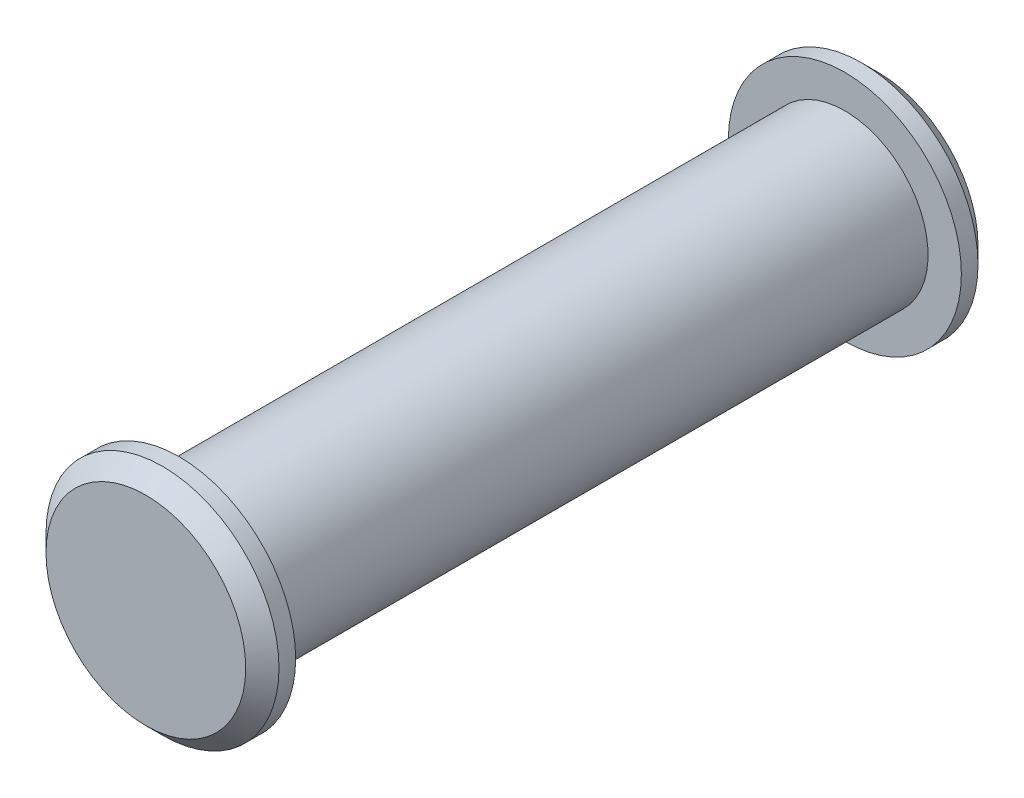
ISO-10303-21;
HEADER;
FILE_DESCRIPTION(('STEP AP214'),'2;1');
FILE_NAME('part.step','',(''),(''),'','','');
FILE_SCHEMA(('AUTOMOTIVE_DESIGN { 1 0 10303 214 1 1 1 1 }'));
ENDSEC;
DATA;
#1=APPLICATION_CONTEXT('core data for automotive mechanical design processes');
#2=APPLICATION_PROTOCOL_DEFINITION('international standard','automotive_design',2000,#1);
#3=PRODUCT_CONTEXT('',#1,'mechanical');
#4=PRODUCT('Part','Part','',(#3));
#5=PRODUCT_RELATED_PRODUCT_CATEGORY('part','',(#4));
#6=PRODUCT_DEFINITION_FORMATION('','',#4);
#7=PRODUCT_DEFINITION_CONTEXT('part definition',#1,'design');
#8=PRODUCT_DEFINITION('design','',#6,#7);
#9=PRODUCT_DEFINITION_SHAPE('','',#8);
#10=(LENGTH_UNIT() NAMED_UNIT(*) SI_UNIT(.MILLI.,.METRE.));
#11=(NAMED_UNIT(*) PLANE_ANGLE_UNIT() SI_UNIT($,.RADIAN.));
#12=(NAMED_UNIT(*) SI_UNIT($,.STERADIAN.) SOLID_ANGLE_UNIT());
#13=UNCERTAINTY_MEASURE_WITH_UNIT(LENGTH_MEASURE(1.E-05),#10,'distance_accuracy_value','');
#14=(GEOMETRIC_REPRESENTATION_CONTEXT(3) GLOBAL_UNCERTAINTY_ASSIGNED_CONTEXT((#13)) GLOBAL_UNIT_ASSIGNED_CONTEXT((#10,
#11,#12)) REPRESENTATION_CONTEXT('',''));
#15=CARTESIAN_POINT('',(0.,0.,0.));
#16=DIRECTION('',(0.,0.,1.));
#17=DIRECTION('',(1.,0.,0.));
#18=AXIS2_PLACEMENT_3D('',#15,#16,#17);
#19=CARTESIAN_POINT('',(0.,0.,10.));
#20=DIRECTION('',(0.,0.,-1.));
#21=DIRECTION('',(-1.,0.,0.));
#22=AXIS2_PLACEMENT_3D('',#19,#20,#21);
#23=CYLINDRICAL_SURFACE('',#22,2.5);
#24=CARTESIAN_POINT('',(0.,0.,10.));
#25=DIRECTION('',(0.,0.,1.));
#26=DIRECTION('',(1.,0.,0.));
#27=AXIS2_PLACEMENT_3D('',#24,#25,#26);
#28=CIRCLE('',#27,2.5);
#29=CARTESIAN_POINT('',(2.5,0.,10.));
#30=VERTEX_POINT('',#29);
#31=EDGE_CURVE('E50',#30,#30,#28,.T.);
#32=ORIENTED_EDGE('',*,*,#31,.F.);
#33=EDGE_LOOP('',(#32));
#34=FACE_BOUND('',#33,.T.);
#35=CARTESIAN_POINT('',(0.,0.,-10.));
#36=DIRECTION('',(0.,0.,-1.));
#37=DIRECTION('',(-1.,0.,0.));
#38=AXIS2_PLACEMENT_3D('',#35,#36,#37);
#39=CIRCLE('',#38,2.5);
#40=CARTESIAN_POINT('',(-2.5,0.,-10.));
#41=VERTEX_POINT('',#40);
#42=EDGE_CURVE('E56',#41,#41,#39,.T.);
#43=ORIENTED_EDGE('',*,*,#42,.F.);
#44=EDGE_LOOP('',(#43));
#45=FACE_BOUND('',#44,.T.);
#46=ADVANCED_FACE('F30',(#34,#45),#23,.T.);
#47=CARTESIAN_POINT('',(0.,0.,10.));
#48=DIRECTION('',(0.,0.,1.));
#49=DIRECTION('',(1.,0.,0.));
#50=AXIS2_PLACEMENT_3D('',#47,#48,#49);
#51=PLANE('',#50);
#52=CARTESIAN_POINT('',(0.,0.,10.));
#53=DIRECTION('',(0.,0.,1.));
#54=DIRECTION('',(1.,0.,0.));
#55=AXIS2_PLACEMENT_3D('',#52,#53,#54);
#56=CIRCLE('',#55,3.5);
#57=CARTESIAN_POINT('',(3.5,0.,10.));
#58=VERTEX_POINT('',#57);
#59=EDGE_CURVE('E53',#58,#58,#56,.T.);
#60=ORIENTED_EDGE('',*,*,#59,.F.);
#61=EDGE_LOOP('',(#60));
#62=FACE_BOUND('',#61,.T.);
#63=ORIENTED_EDGE('',*,*,#31,.T.);
#64=EDGE_LOOP('',(#63));
#65=FACE_BOUND('',#64,.T.);
#66=ADVANCED_FACE('F82',(#62,#65),#51,.F.);
#67=CARTESIAN_POINT('',(0.,0.,11.));
#68=DIRECTION('',(0.,0.,-1.));
#69=DIRECTION('',(-1.,0.,0.));
#70=AXIS2_PLACEMENT_3D('',#67,#68,#69);
#71=CYLINDRICAL_SURFACE('',#70,3.5);
#72=CARTESIAN_POINT('',(0.,0.,10.5));
#73=DIRECTION('',(0.,0.,1.));
#74=DIRECTION('',(1.,0.,0.));
#75=AXIS2_PLACEMENT_3D('',#72,#73,#74);
#76=CIRCLE('',#75,3.5);
#77=CARTESIAN_POINT('',(3.5,0.,10.5));
#78=VERTEX_POINT('',#77);
#79=EDGE_CURVE('E10',#78,#78,#76,.F.);
#80=ORIENTED_EDGE('',*,*,#79,.T.);
#81=EDGE_LOOP('',(#80));
#82=FACE_BOUND('',#81,.T.);
#83=ORIENTED_EDGE('',*,*,#59,.T.);
#84=EDGE_LOOP('',(#83));
#85=FACE_BOUND('',#84,.T.);
#86=ADVANCED_FACE('F88',(#82,#85),#71,.T.);
#87=CARTESIAN_POINT('',(0.,0.,11.));
#88=DIRECTION('',(0.,0.,1.));
#89=DIRECTION('',(1.,0.,0.));
#90=AXIS2_PLACEMENT_3D('',#87,#88,#89);
#91=PLANE('',#90);
#92=CARTESIAN_POINT('',(0.,0.,11.));
#93=DIRECTION('',(0.,0.,1.));
#94=DIRECTION('',(1.,0.,0.));
#95=AXIS2_PLACEMENT_3D('',#92,#93,#94);
#96=CIRCLE('',#95,3.);
#97=CARTESIAN_POINT('',(3.,0.,11.));
#98=VERTEX_POINT('',#97);
#99=EDGE_CURVE('E37',#98,#98,#96,.T.);
#100=ORIENTED_EDGE('',*,*,#99,.T.);
#101=EDGE_LOOP('',(#100));
#102=FACE_BOUND('',#101,.T.);
#103=ADVANCED_FACE('F78',(#102),#91,.T.);
#104=CARTESIAN_POINT('',(0.,0.,-10.));
#105=DIRECTION('',(0.,0.,-1.));
#106=DIRECTION('',(1.,0.,0.));
#107=AXIS2_PLACEMENT_3D('',#104,#105,#106);
#108=PLANE('',#107);
#109=CARTESIAN_POINT('',(0.,0.,-10.));
#110=DIRECTION('',(0.,0.,1.));
#111=DIRECTION('',(1.,0.,0.));
#112=AXIS2_PLACEMENT_3D('',#109,#110,#111);
#113=CIRCLE('',#112,3.5);
#114=CARTESIAN_POINT('',(3.5,0.,-10.));
#115=VERTEX_POINT('',#114);
#116=EDGE_CURVE('E59',#115,#115,#113,.T.);
#117=ORIENTED_EDGE('',*,*,#116,.T.);
#118=EDGE_LOOP('',(#117));
#119=FACE_BOUND('',#118,.T.);
#120=ORIENTED_EDGE('',*,*,#42,.T.);
#121=EDGE_LOOP('',(#120));
#122=FACE_BOUND('',#121,.T.);
#123=ADVANCED_FACE('F63',(#119,#122),#108,.F.);
#124=CARTESIAN_POINT('',(0.,0.,-11.));
#125=DIRECTION('',(0.,0.,1.));
#126=DIRECTION('',(1.,0.,0.));
#127=AXIS2_PLACEMENT_3D('',#124,#125,#126);
#128=CYLINDRICAL_SURFACE('',#127,3.5);
#129=CARTESIAN_POINT('',(0.,0.,-10.5));
#130=DIRECTION('',(0.,0.,-1.));
#131=DIRECTION('',(-1.,0.,0.));
#132=AXIS2_PLACEMENT_3D('',#129,#130,#131);
#133=CIRCLE('',#132,3.5);
#134=CARTESIAN_POINT('',(-3.5,0.,-10.5));
#135=VERTEX_POINT('',#134);
#136=EDGE_CURVE('E45',#135,#135,#133,.F.);
#137=ORIENTED_EDGE('',*,*,#136,.T.);
#138=EDGE_LOOP('',(#137));
#139=FACE_BOUND('',#138,.T.);
#140=ORIENTED_EDGE('',*,*,#116,.F.);
#141=EDGE_LOOP('',(#140));
#142=FACE_BOUND('',#141,.T.);
#143=ADVANCED_FACE('F66',(#139,#142),#128,.T.);
#144=CARTESIAN_POINT('',(0.,0.,-11.));
#145=DIRECTION('',(0.,0.,-1.));
#146=DIRECTION('',(1.,0.,0.));
#147=AXIS2_PLACEMENT_3D('',#144,#145,#146);
#148=PLANE('',#147);
#149=CARTESIAN_POINT('',(0.,0.,-11.));
#150=DIRECTION('',(0.,0.,-1.));
#151=DIRECTION('',(-1.,0.,0.));
#152=AXIS2_PLACEMENT_3D('',#149,#150,#151);
#153=CIRCLE('',#152,3.);
#154=CARTESIAN_POINT('',(-3.,0.,-11.));
#155=VERTEX_POINT('',#154);
#156=EDGE_CURVE('E41',#155,#155,#153,.T.);
#157=ORIENTED_EDGE('',*,*,#156,.T.);
#158=EDGE_LOOP('',(#157));
#159=FACE_BOUND('',#158,.T.);
#160=ADVANCED_FACE('F68',(#159),#148,.T.);
#161=CARTESIAN_POINT('',(0.,0.,-10.5));
#162=DIRECTION('',(0.,0.,1.));
#163=DIRECTION('',(1.,0.,0.));
#164=AXIS2_PLACEMENT_3D('',#161,#162,#163);
#165=CONICAL_SURFACE('',#164,3.5,0.78539816339745);
#166=ORIENTED_EDGE('',*,*,#156,.F.);
#167=EDGE_LOOP('',(#166));
#168=FACE_BOUND('',#167,.T.);
#169=ORIENTED_EDGE('',*,*,#136,.F.);
#170=EDGE_LOOP('',(#169));
#171=FACE_BOUND('',#170,.T.);
#172=ADVANCED_FACE('F75',(#168,#171),#165,.T.);
#173=CARTESIAN_POINT('',(0.,0.,11.));
#174=DIRECTION('',(0.,0.,-1.));
#175=DIRECTION('',(-1.,0.,0.));
#176=AXIS2_PLACEMENT_3D('',#173,#174,#175);
#177=CONICAL_SURFACE('',#176,3.,0.785398163397447);
#178=ORIENTED_EDGE('',*,*,#79,.F.);
#179=EDGE_LOOP('',(#178));
#180=FACE_BOUND('',#179,.T.);
#181=ORIENTED_EDGE('',*,*,#99,.F.);
#182=EDGE_LOOP('',(#181));
#183=FACE_BOUND('',#182,.T.);
#184=ADVANCED_FACE('F32',(#180,#183),#177,.T.);
#185=CLOSED_SHELL('',(#46,#66,#86,#103,#123,#143,#160,#172,#184));
#186=MANIFOLD_SOLID_BREP('B2',#185);
#187=ADVANCED_BREP_SHAPE_REPRESENTATION('',(#18,#186),#14);
#188=SHAPE_DEFINITION_REPRESENTATION(#9,#187);
ENDSEC;
END-ISO-10303-21;
